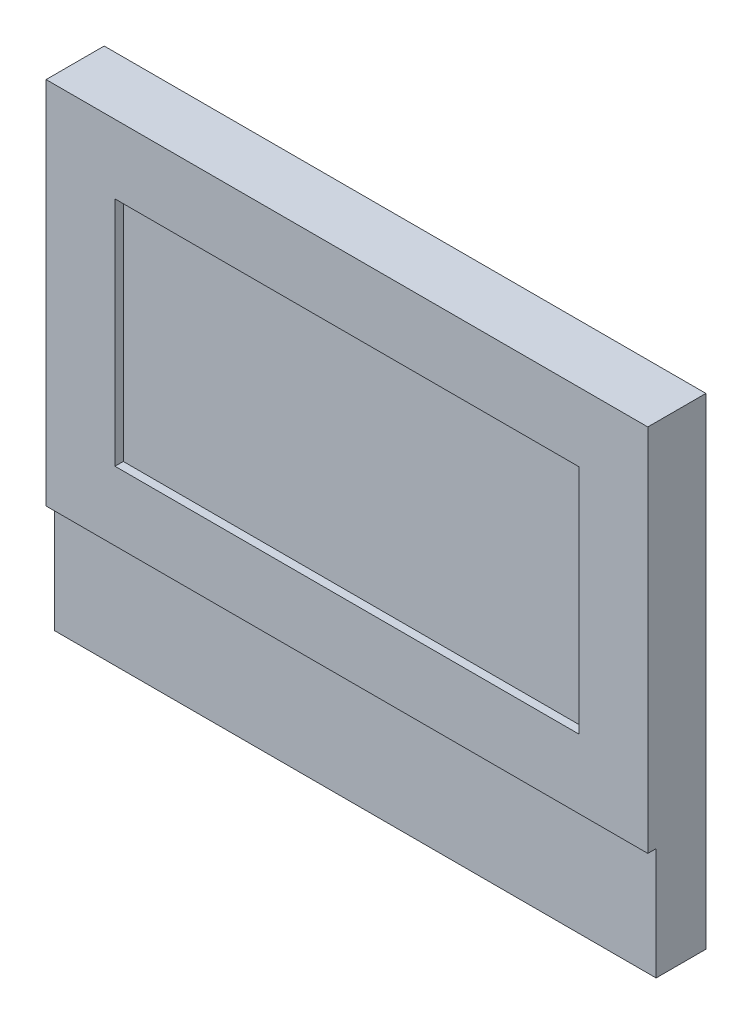
ISO-10303-21;
HEADER;
FILE_DESCRIPTION(('STEP AP214'),'2;1');
FILE_NAME('part.step','',(''),(''),'','','');
FILE_SCHEMA(('AUTOMOTIVE_DESIGN { 1 0 10303 214 1 1 1 1 }'));
ENDSEC;
DATA;
#1=APPLICATION_CONTEXT('core data for automotive mechanical design processes');
#2=APPLICATION_PROTOCOL_DEFINITION('international standard','automotive_design',2000,#1);
#3=PRODUCT_CONTEXT('',#1,'mechanical');
#4=PRODUCT('Part','Part','',(#3));
#5=PRODUCT_RELATED_PRODUCT_CATEGORY('part','',(#4));
#6=PRODUCT_DEFINITION_FORMATION('','',#4);
#7=PRODUCT_DEFINITION_CONTEXT('part definition',#1,'design');
#8=PRODUCT_DEFINITION('design','',#6,#7);
#9=PRODUCT_DEFINITION_SHAPE('','',#8);
#10=(LENGTH_UNIT() NAMED_UNIT(*) SI_UNIT(.MILLI.,.METRE.));
#11=(NAMED_UNIT(*) PLANE_ANGLE_UNIT() SI_UNIT($,.RADIAN.));
#12=(NAMED_UNIT(*) SI_UNIT($,.STERADIAN.) SOLID_ANGLE_UNIT());
#13=UNCERTAINTY_MEASURE_WITH_UNIT(LENGTH_MEASURE(1.E-05),#10,'distance_accuracy_value','');
#14=(GEOMETRIC_REPRESENTATION_CONTEXT(3) GLOBAL_UNCERTAINTY_ASSIGNED_CONTEXT((#13)) GLOBAL_UNIT_ASSIGNED_CONTEXT((#10,
#11,#12)) REPRESENTATION_CONTEXT('',''));
#15=CARTESIAN_POINT('',(0.,0.,0.));
#16=DIRECTION('',(0.,0.,1.));
#17=DIRECTION('',(1.,0.,0.));
#18=AXIS2_PLACEMENT_3D('',#15,#16,#17);
#19=CARTESIAN_POINT('',(72.5,58.,12.));
#20=DIRECTION('',(-1.,0.,0.));
#21=DIRECTION('',(0.,-1.,0.));
#22=AXIS2_PLACEMENT_3D('',#19,#20,#21);
#23=PLANE('',#22);
#24=DIRECTION('',(0.,1.,0.));
#25=VECTOR('',#24,1.);
#26=CARTESIAN_POINT('',(72.5,58.,0.));
#27=LINE('',#26,#25);
#28=CARTESIAN_POINT('',(72.5,-58.,0.));
#29=VERTEX_POINT('',#28);
#30=CARTESIAN_POINT('',(72.5,58.,0.));
#31=VERTEX_POINT('',#30);
#32=EDGE_CURVE('E188',#29,#31,#27,.T.);
#33=ORIENTED_EDGE('',*,*,#32,.T.);
#34=DIRECTION('',(0.,0.,-1.));
#35=VECTOR('',#34,1.);
#36=CARTESIAN_POINT('',(72.5,58.,12.));
#37=LINE('',#36,#35);
#38=CARTESIAN_POINT('',(72.5,58.,14.));
#39=VERTEX_POINT('',#38);
#40=EDGE_CURVE('E12',#39,#31,#37,.T.);
#41=ORIENTED_EDGE('',*,*,#40,.F.);
#42=DIRECTION('',(0.,-1.,0.));
#43=VECTOR('',#42,1.);
#44=CARTESIAN_POINT('',(72.5,58.,14.));
#45=LINE('',#44,#43);
#46=CARTESIAN_POINT('',(72.5,-31.,14.));
#47=VERTEX_POINT('',#46);
#48=EDGE_CURVE('E175',#39,#47,#45,.T.);
#49=ORIENTED_EDGE('',*,*,#48,.T.);
#50=DIRECTION('',(0.,0.,-1.));
#51=VECTOR('',#50,1.);
#52=CARTESIAN_POINT('',(72.5,-31.,14.));
#53=LINE('',#52,#51);
#54=CARTESIAN_POINT('',(72.5,-31.,12.));
#55=VERTEX_POINT('',#54);
#56=EDGE_CURVE('E182',#47,#55,#53,.T.);
#57=ORIENTED_EDGE('',*,*,#56,.T.);
#58=DIRECTION('',(0.,1.,0.));
#59=VECTOR('',#58,1.);
#60=CARTESIAN_POINT('',(72.5,58.,12.));
#61=LINE('',#60,#59);
#62=CARTESIAN_POINT('',(72.5,-58.,12.));
#63=VERTEX_POINT('',#62);
#64=EDGE_CURVE('E191',#63,#55,#61,.T.);
#65=ORIENTED_EDGE('',*,*,#64,.F.);
#66=DIRECTION('',(0.,0.,-1.));
#67=VECTOR('',#66,1.);
#68=CARTESIAN_POINT('',(72.5,-58.,12.));
#69=LINE('',#68,#67);
#70=EDGE_CURVE('E198',#63,#29,#69,.T.);
#71=ORIENTED_EDGE('',*,*,#70,.T.);
#72=EDGE_LOOP('',(#33,#41,#49,#57,#65,#71));
#73=FACE_BOUND('',#72,.T.);
#74=ADVANCED_FACE('F59',(#73),#23,.F.);
#75=CARTESIAN_POINT('',(-72.5,58.,12.));
#76=DIRECTION('',(0.,-1.,0.));
#77=DIRECTION('',(0.,0.,-1.));
#78=AXIS2_PLACEMENT_3D('',#75,#76,#77);
#79=PLANE('',#78);
#80=DIRECTION('',(-1.,0.,0.));
#81=VECTOR('',#80,1.);
#82=CARTESIAN_POINT('',(-72.5,58.,0.));
#83=LINE('',#82,#81);
#84=CARTESIAN_POINT('',(-72.5,58.,0.));
#85=VERTEX_POINT('',#84);
#86=EDGE_CURVE('E201',#31,#85,#83,.T.);
#87=ORIENTED_EDGE('',*,*,#86,.T.);
#88=DIRECTION('',(0.,0.,-1.));
#89=VECTOR('',#88,1.);
#90=CARTESIAN_POINT('',(-72.5,58.,12.));
#91=LINE('',#90,#89);
#92=CARTESIAN_POINT('',(-72.5,58.,14.));
#93=VERTEX_POINT('',#92);
#94=EDGE_CURVE('E66',#93,#85,#91,.T.);
#95=ORIENTED_EDGE('',*,*,#94,.F.);
#96=DIRECTION('',(1.,0.,0.));
#97=VECTOR('',#96,1.);
#98=CARTESIAN_POINT('',(-72.5,58.,14.));
#99=LINE('',#98,#97);
#100=EDGE_CURVE('E172',#93,#39,#99,.T.);
#101=ORIENTED_EDGE('',*,*,#100,.T.);
#102=ORIENTED_EDGE('',*,*,#40,.T.);
#103=EDGE_LOOP('',(#87,#95,#101,#102));
#104=FACE_BOUND('',#103,.T.);
#105=ADVANCED_FACE('F238',(#104),#79,.F.);
#106=CARTESIAN_POINT('',(-72.5,58.,12.));
#107=DIRECTION('',(1.,0.,0.));
#108=DIRECTION('',(0.,1.,0.));
#109=AXIS2_PLACEMENT_3D('',#106,#107,#108);
#110=PLANE('',#109);
#111=DIRECTION('',(0.,-1.,0.));
#112=VECTOR('',#111,1.);
#113=CARTESIAN_POINT('',(-72.5,58.,0.));
#114=LINE('',#113,#112);
#115=CARTESIAN_POINT('',(-72.5,-58.,0.));
#116=VERTEX_POINT('',#115);
#117=EDGE_CURVE('E203',#85,#116,#114,.T.);
#118=ORIENTED_EDGE('',*,*,#117,.T.);
#119=DIRECTION('',(0.,0.,-1.));
#120=VECTOR('',#119,1.);
#121=CARTESIAN_POINT('',(-72.5,-58.,12.));
#122=LINE('',#121,#120);
#123=CARTESIAN_POINT('',(-72.5,-58.,12.));
#124=VERTEX_POINT('',#123);
#125=EDGE_CURVE('E208',#124,#116,#122,.T.);
#126=ORIENTED_EDGE('',*,*,#125,.F.);
#127=DIRECTION('',(0.,-1.,0.));
#128=VECTOR('',#127,1.);
#129=CARTESIAN_POINT('',(-72.5,58.,12.));
#130=LINE('',#129,#128);
#131=CARTESIAN_POINT('',(-72.5,-30.9999999999999,12.));
#132=VERTEX_POINT('',#131);
#133=EDGE_CURVE('E193',#132,#124,#130,.T.);
#134=ORIENTED_EDGE('',*,*,#133,.F.);
#135=DIRECTION('',(0.,0.,-1.));
#136=VECTOR('',#135,1.);
#137=CARTESIAN_POINT('',(-72.5,-31.,14.));
#138=LINE('',#137,#136);
#139=CARTESIAN_POINT('',(-72.5,-31.,14.));
#140=VERTEX_POINT('',#139);
#141=EDGE_CURVE('E185',#140,#132,#138,.T.);
#142=ORIENTED_EDGE('',*,*,#141,.F.);
#143=DIRECTION('',(0.,-1.,0.));
#144=VECTOR('',#143,1.);
#145=CARTESIAN_POINT('',(-72.5,58.,14.));
#146=LINE('',#145,#144);
#147=EDGE_CURVE('E180',#93,#140,#146,.T.);
#148=ORIENTED_EDGE('',*,*,#147,.F.);
#149=ORIENTED_EDGE('',*,*,#94,.T.);
#150=EDGE_LOOP('',(#118,#126,#134,#142,#148,#149));
#151=FACE_BOUND('',#150,.T.);
#152=ADVANCED_FACE('F214',(#151),#110,.F.);
#153=CARTESIAN_POINT('',(-72.5,-58.,12.));
#154=DIRECTION('',(0.,1.,0.));
#155=DIRECTION('',(0.,0.,1.));
#156=AXIS2_PLACEMENT_3D('',#153,#154,#155);
#157=PLANE('',#156);
#158=DIRECTION('',(1.,0.,0.));
#159=VECTOR('',#158,1.);
#160=CARTESIAN_POINT('',(-72.5,-58.,0.));
#161=LINE('',#160,#159);
#162=EDGE_CURVE('E194',#116,#29,#161,.T.);
#163=ORIENTED_EDGE('',*,*,#162,.T.);
#164=ORIENTED_EDGE('',*,*,#70,.F.);
#165=DIRECTION('',(1.,0.,0.));
#166=VECTOR('',#165,1.);
#167=CARTESIAN_POINT('',(-72.5,-58.,12.));
#168=LINE('',#167,#166);
#169=EDGE_CURVE('E196',#124,#63,#168,.T.);
#170=ORIENTED_EDGE('',*,*,#169,.F.);
#171=ORIENTED_EDGE('',*,*,#125,.T.);
#172=EDGE_LOOP('',(#163,#164,#170,#171));
#173=FACE_BOUND('',#172,.T.);
#174=ADVANCED_FACE('F225',(#173),#157,.F.);
#175=CARTESIAN_POINT('',(0.,0.,12.));
#176=DIRECTION('',(0.,0.,1.));
#177=DIRECTION('',(1.,0.,0.));
#178=AXIS2_PLACEMENT_3D('',#175,#176,#177);
#179=PLANE('',#178);
#180=DIRECTION('',(1.,0.,0.));
#181=VECTOR('',#180,1.);
#182=CARTESIAN_POINT('',(-72.5,-31.,12.));
#183=LINE('',#182,#181);
#184=EDGE_CURVE('E151',#132,#55,#183,.T.);
#185=ORIENTED_EDGE('',*,*,#184,.F.);
#186=ORIENTED_EDGE('',*,*,#133,.T.);
#187=ORIENTED_EDGE('',*,*,#169,.T.);
#188=ORIENTED_EDGE('',*,*,#64,.T.);
#189=EDGE_LOOP('',(#185,#186,#187,#188));
#190=FACE_BOUND('',#189,.T.);
#191=ADVANCED_FACE('F231',(#190),#179,.T.);
#192=CARTESIAN_POINT('',(0.,0.,0.));
#193=DIRECTION('',(0.,0.,1.));
#194=DIRECTION('',(1.,0.,0.));
#195=AXIS2_PLACEMENT_3D('',#192,#193,#194);
#196=PLANE('',#195);
#197=ORIENTED_EDGE('',*,*,#32,.F.);
#198=ORIENTED_EDGE('',*,*,#162,.F.);
#199=ORIENTED_EDGE('',*,*,#117,.F.);
#200=ORIENTED_EDGE('',*,*,#86,.F.);
#201=EDGE_LOOP('',(#197,#198,#199,#200));
#202=FACE_BOUND('',#201,.T.);
#203=ADVANCED_FACE('F222',(#202),#196,.F.);
#204=CARTESIAN_POINT('',(0.,0.,14.));
#205=DIRECTION('',(0.,0.,-1.));
#206=DIRECTION('',(-1.,0.,0.));
#207=AXIS2_PLACEMENT_3D('',#204,#205,#206);
#208=PLANE('',#207);
#209=ORIENTED_EDGE('',*,*,#100,.F.);
#210=ORIENTED_EDGE('',*,*,#147,.T.);
#211=DIRECTION('',(1.,0.,0.));
#212=VECTOR('',#211,1.);
#213=CARTESIAN_POINT('',(-72.5,-31.,14.));
#214=LINE('',#213,#212);
#215=EDGE_CURVE('E178',#140,#47,#214,.T.);
#216=ORIENTED_EDGE('',*,*,#215,.T.);
#217=ORIENTED_EDGE('',*,*,#48,.F.);
#218=EDGE_LOOP('',(#209,#210,#216,#217));
#219=FACE_BOUND('',#218,.T.);
#220=DIRECTION('',(1.,0.,0.));
#221=VECTOR('',#220,1.);
#222=CARTESIAN_POINT('',(0.,-14.4,14.));
#223=LINE('',#222,#221);
#224=CARTESIAN_POINT('',(-55.9,-14.4,14.));
#225=VERTEX_POINT('',#224);
#226=CARTESIAN_POINT('',(55.9,-14.4,14.));
#227=VERTEX_POINT('',#226);
#228=EDGE_CURVE('E133',#225,#227,#223,.T.);
#229=ORIENTED_EDGE('',*,*,#228,.F.);
#230=DIRECTION('',(0.,-1.,0.));
#231=VECTOR('',#230,1.);
#232=CARTESIAN_POINT('',(-55.9,0.,14.));
#233=LINE('',#232,#231);
#234=CARTESIAN_POINT('',(-55.9,41.4,14.));
#235=VERTEX_POINT('',#234);
#236=EDGE_CURVE('E157',#235,#225,#233,.T.);
#237=ORIENTED_EDGE('',*,*,#236,.F.);
#238=DIRECTION('',(1.,0.,0.));
#239=VECTOR('',#238,1.);
#240=CARTESIAN_POINT('',(0.,41.4,14.));
#241=LINE('',#240,#239);
#242=CARTESIAN_POINT('',(55.9,41.4,14.));
#243=VERTEX_POINT('',#242);
#244=EDGE_CURVE('E155',#235,#243,#241,.T.);
#245=ORIENTED_EDGE('',*,*,#244,.T.);
#246=DIRECTION('',(0.,-1.,0.));
#247=VECTOR('',#246,1.);
#248=CARTESIAN_POINT('',(55.9,0.,14.));
#249=LINE('',#248,#247);
#250=EDGE_CURVE('E143',#243,#227,#249,.T.);
#251=ORIENTED_EDGE('',*,*,#250,.T.);
#252=EDGE_LOOP('',(#229,#237,#245,#251));
#253=FACE_BOUND('',#252,.T.);
#254=ADVANCED_FACE('F154',(#219,#253),#208,.F.);
#255=CARTESIAN_POINT('',(-72.5,-31.,14.));
#256=DIRECTION('',(0.,1.,0.));
#257=DIRECTION('',(-1.,0.,0.));
#258=AXIS2_PLACEMENT_3D('',#255,#256,#257);
#259=PLANE('',#258);
#260=ORIENTED_EDGE('',*,*,#184,.T.);
#261=ORIENTED_EDGE('',*,*,#56,.F.);
#262=ORIENTED_EDGE('',*,*,#215,.F.);
#263=ORIENTED_EDGE('',*,*,#141,.T.);
#264=EDGE_LOOP('',(#260,#261,#262,#263));
#265=FACE_BOUND('',#264,.T.);
#266=ADVANCED_FACE('F235',(#265),#259,.F.);
#267=CARTESIAN_POINT('',(0.,-14.4,14.));
#268=DIRECTION('',(0.,1.,0.));
#269=DIRECTION('',(-1.,0.,0.));
#270=AXIS2_PLACEMENT_3D('',#267,#268,#269);
#271=PLANE('',#270);
#272=DIRECTION('',(1.,0.,0.));
#273=VECTOR('',#272,1.);
#274=CARTESIAN_POINT('',(0.,-14.4,12.));
#275=LINE('',#274,#273);
#276=CARTESIAN_POINT('',(-55.9,-14.4,12.));
#277=VERTEX_POINT('',#276);
#278=CARTESIAN_POINT('',(55.9,-14.4,12.));
#279=VERTEX_POINT('',#278);
#280=EDGE_CURVE('E77',#277,#279,#275,.T.);
#281=ORIENTED_EDGE('',*,*,#280,.F.);
#282=DIRECTION('',(0.,0.,-1.));
#283=VECTOR('',#282,1.);
#284=CARTESIAN_POINT('',(-55.9,-14.4,14.));
#285=LINE('',#284,#283);
#286=EDGE_CURVE('E139',#225,#277,#285,.T.);
#287=ORIENTED_EDGE('',*,*,#286,.F.);
#288=ORIENTED_EDGE('',*,*,#228,.T.);
#289=DIRECTION('',(0.,0.,-1.));
#290=VECTOR('',#289,1.);
#291=CARTESIAN_POINT('',(55.9,-14.4,14.));
#292=LINE('',#291,#290);
#293=EDGE_CURVE('E136',#227,#279,#292,.T.);
#294=ORIENTED_EDGE('',*,*,#293,.T.);
#295=EDGE_LOOP('',(#281,#287,#288,#294));
#296=FACE_BOUND('',#295,.T.);
#297=ADVANCED_FACE('F135',(#296),#271,.T.);
#298=CARTESIAN_POINT('',(55.9,0.,14.));
#299=DIRECTION('',(1.,0.,0.));
#300=DIRECTION('',(0.,0.,-1.));
#301=AXIS2_PLACEMENT_3D('',#298,#299,#300);
#302=PLANE('',#301);
#303=DIRECTION('',(0.,-1.,0.));
#304=VECTOR('',#303,1.);
#305=CARTESIAN_POINT('',(55.9,0.,12.));
#306=LINE('',#305,#304);
#307=CARTESIAN_POINT('',(55.9,41.4,12.));
#308=VERTEX_POINT('',#307);
#309=EDGE_CURVE('E150',#308,#279,#306,.T.);
#310=ORIENTED_EDGE('',*,*,#309,.T.);
#311=ORIENTED_EDGE('',*,*,#293,.F.);
#312=ORIENTED_EDGE('',*,*,#250,.F.);
#313=DIRECTION('',(0.,0.,-1.));
#314=VECTOR('',#313,1.);
#315=CARTESIAN_POINT('',(55.9,41.4,14.));
#316=LINE('',#315,#314);
#317=EDGE_CURVE('E152',#243,#308,#316,.T.);
#318=ORIENTED_EDGE('',*,*,#317,.T.);
#319=EDGE_LOOP('',(#310,#311,#312,#318));
#320=FACE_BOUND('',#319,.T.);
#321=ADVANCED_FACE('F147',(#320),#302,.F.);
#322=CARTESIAN_POINT('',(0.,41.4,14.));
#323=DIRECTION('',(0.,1.,0.));
#324=DIRECTION('',(-1.,0.,0.));
#325=AXIS2_PLACEMENT_3D('',#322,#323,#324);
#326=PLANE('',#325);
#327=DIRECTION('',(1.,0.,0.));
#328=VECTOR('',#327,1.);
#329=CARTESIAN_POINT('',(0.,41.4,12.));
#330=LINE('',#329,#328);
#331=CARTESIAN_POINT('',(-55.9,41.4,12.));
#332=VERTEX_POINT('',#331);
#333=EDGE_CURVE('E163',#332,#308,#330,.T.);
#334=ORIENTED_EDGE('',*,*,#333,.T.);
#335=ORIENTED_EDGE('',*,*,#317,.F.);
#336=ORIENTED_EDGE('',*,*,#244,.F.);
#337=DIRECTION('',(0.,0.,-1.));
#338=VECTOR('',#337,1.);
#339=CARTESIAN_POINT('',(-55.9,41.4,14.));
#340=LINE('',#339,#338);
#341=EDGE_CURVE('E168',#235,#332,#340,.T.);
#342=ORIENTED_EDGE('',*,*,#341,.T.);
#343=EDGE_LOOP('',(#334,#335,#336,#342));
#344=FACE_BOUND('',#343,.T.);
#345=ADVANCED_FACE('F261',(#344),#326,.F.);
#346=CARTESIAN_POINT('',(-55.9,0.,14.));
#347=DIRECTION('',(1.,0.,0.));
#348=DIRECTION('',(0.,1.,0.));
#349=AXIS2_PLACEMENT_3D('',#346,#347,#348);
#350=PLANE('',#349);
#351=DIRECTION('',(0.,-1.,0.));
#352=VECTOR('',#351,1.);
#353=CARTESIAN_POINT('',(-55.9,0.,12.));
#354=LINE('',#353,#352);
#355=EDGE_CURVE('E73',#332,#277,#354,.T.);
#356=ORIENTED_EDGE('',*,*,#355,.F.);
#357=ORIENTED_EDGE('',*,*,#341,.F.);
#358=ORIENTED_EDGE('',*,*,#236,.T.);
#359=ORIENTED_EDGE('',*,*,#286,.T.);
#360=EDGE_LOOP('',(#356,#357,#358,#359));
#361=FACE_BOUND('',#360,.T.);
#362=ADVANCED_FACE('F264',(#361),#350,.T.);
#363=ORIENTED_EDGE('',*,*,#333,.F.);
#364=ORIENTED_EDGE('',*,*,#355,.T.);
#365=ORIENTED_EDGE('',*,*,#280,.T.);
#366=ORIENTED_EDGE('',*,*,#309,.F.);
#367=EDGE_LOOP('',(#363,#364,#365,#366));
#368=FACE_BOUND('',#367,.T.);
#369=ADVANCED_FACE('F252',(#368),#179,.T.);
#370=CLOSED_SHELL('',(#74,#105,#152,#174,#191,#203,#254,#266,#297,#321,#345,#362,#369));
#371=MANIFOLD_SOLID_BREP('B2',#370);
#372=ADVANCED_BREP_SHAPE_REPRESENTATION('',(#18,#371),#14);
#373=SHAPE_DEFINITION_REPRESENTATION(#9,#372);
ENDSEC;
END-ISO-10303-21;
